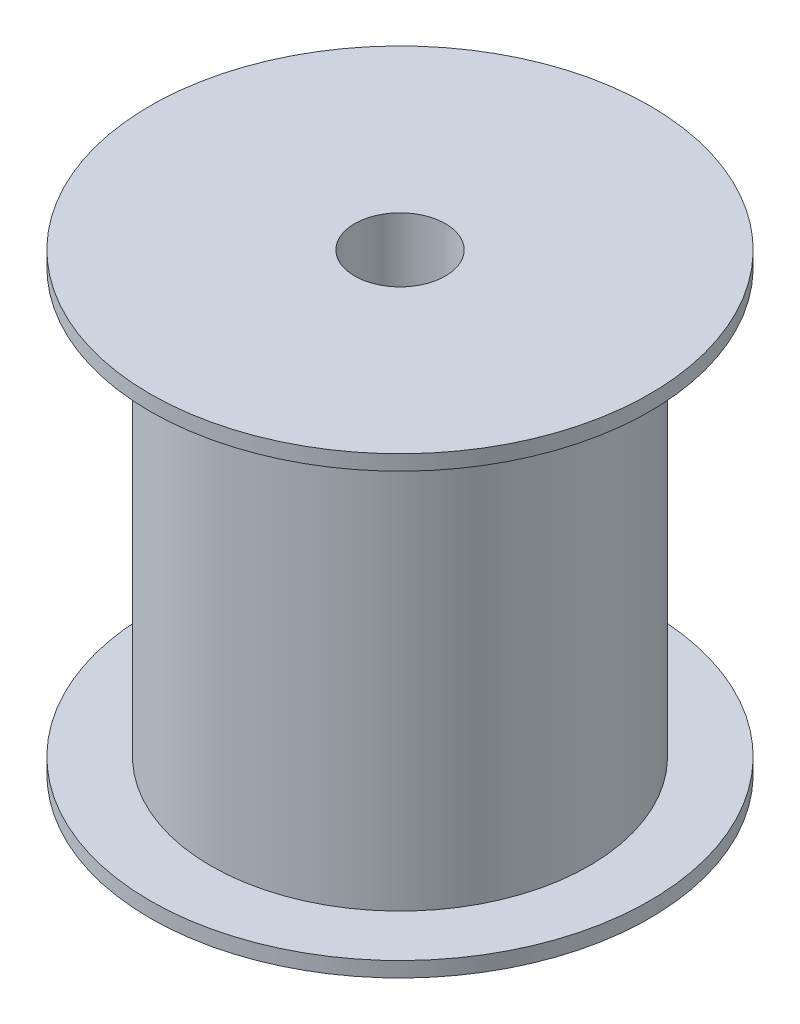
ISO-10303-21;
HEADER;
FILE_DESCRIPTION(('STEP AP214'),'2;1');
FILE_NAME('part.step','',(''),(''),'','','');
FILE_SCHEMA(('AUTOMOTIVE_DESIGN { 1 0 10303 214 1 1 1 1 }'));
ENDSEC;
DATA;
#1=APPLICATION_CONTEXT('core data for automotive mechanical design processes');
#2=APPLICATION_PROTOCOL_DEFINITION('international standard','automotive_design',2000,#1);
#3=PRODUCT_CONTEXT('',#1,'mechanical');
#4=PRODUCT('Part','Part','',(#3));
#5=PRODUCT_RELATED_PRODUCT_CATEGORY('part','',(#4));
#6=PRODUCT_DEFINITION_FORMATION('','',#4);
#7=PRODUCT_DEFINITION_CONTEXT('part definition',#1,'design');
#8=PRODUCT_DEFINITION('design','',#6,#7);
#9=PRODUCT_DEFINITION_SHAPE('','',#8);
#10=(LENGTH_UNIT() NAMED_UNIT(*) SI_UNIT(.MILLI.,.METRE.));
#11=(NAMED_UNIT(*) PLANE_ANGLE_UNIT() SI_UNIT($,.RADIAN.));
#12=(NAMED_UNIT(*) SI_UNIT($,.STERADIAN.) SOLID_ANGLE_UNIT());
#13=UNCERTAINTY_MEASURE_WITH_UNIT(LENGTH_MEASURE(1.E-05),#10,'distance_accuracy_value','');
#14=(GEOMETRIC_REPRESENTATION_CONTEXT(3) GLOBAL_UNCERTAINTY_ASSIGNED_CONTEXT((#13)) GLOBAL_UNIT_ASSIGNED_CONTEXT((#10,
#11,#12)) REPRESENTATION_CONTEXT('',''));
#15=CARTESIAN_POINT('',(0.,0.,0.));
#16=DIRECTION('',(0.,0.,1.));
#17=DIRECTION('',(1.,0.,0.));
#18=AXIS2_PLACEMENT_3D('',#15,#16,#17);
#19=CARTESIAN_POINT('',(0.,30.,0.));
#20=DIRECTION('',(0.,-1.,0.));
#21=DIRECTION('',(0.,0.,-1.));
#22=AXIS2_PLACEMENT_3D('',#19,#20,#21);
#23=CYLINDRICAL_SURFACE('',#22,12.5);
#24=CARTESIAN_POINT('',(0.,1.,0.));
#25=DIRECTION('',(0.,1.,0.));
#26=DIRECTION('',(0.,0.,1.));
#27=AXIS2_PLACEMENT_3D('',#24,#25,#26);
#28=CIRCLE('',#27,12.5);
#29=CARTESIAN_POINT('',(0.,1.,12.5));
#30=VERTEX_POINT('',#29);
#31=EDGE_CURVE('E47',#30,#30,#28,.T.);
#32=ORIENTED_EDGE('',*,*,#31,.T.);
#33=EDGE_LOOP('',(#32));
#34=FACE_BOUND('',#33,.T.);
#35=CARTESIAN_POINT('',(0.,29.,0.));
#36=DIRECTION('',(0.,1.,0.));
#37=DIRECTION('',(0.,0.,1.));
#38=AXIS2_PLACEMENT_3D('',#35,#36,#37);
#39=CIRCLE('',#38,12.5);
#40=CARTESIAN_POINT('',(0.,29.,12.5));
#41=VERTEX_POINT('',#40);
#42=EDGE_CURVE('E10',#41,#41,#39,.T.);
#43=ORIENTED_EDGE('',*,*,#42,.F.);
#44=EDGE_LOOP('',(#43));
#45=FACE_BOUND('',#44,.T.);
#46=ADVANCED_FACE('F32',(#34,#45),#23,.T.);
#47=CARTESIAN_POINT('',(0.,1.,0.));
#48=DIRECTION('',(0.,1.,0.));
#49=DIRECTION('',(0.,0.,1.));
#50=AXIS2_PLACEMENT_3D('',#47,#48,#49);
#51=PLANE('',#50);
#52=CARTESIAN_POINT('',(0.,1.,0.));
#53=DIRECTION('',(0.,1.,0.));
#54=DIRECTION('',(0.,0.,1.));
#55=AXIS2_PLACEMENT_3D('',#52,#53,#54);
#56=CIRCLE('',#55,16.5);
#57=CARTESIAN_POINT('',(0.,1.,16.5));
#58=VERTEX_POINT('',#57);
#59=EDGE_CURVE('E38',#58,#58,#56,.T.);
#60=ORIENTED_EDGE('',*,*,#59,.T.);
#61=EDGE_LOOP('',(#60));
#62=FACE_BOUND('',#61,.T.);
#63=ORIENTED_EDGE('',*,*,#31,.F.);
#64=EDGE_LOOP('',(#63));
#65=FACE_BOUND('',#64,.T.);
#66=ADVANCED_FACE('F99',(#62,#65),#51,.T.);
#67=CARTESIAN_POINT('',(0.,1.,0.));
#68=DIRECTION('',(0.,-1.,0.));
#69=DIRECTION('',(0.,0.,-1.));
#70=AXIS2_PLACEMENT_3D('',#67,#68,#69);
#71=CYLINDRICAL_SURFACE('',#70,16.5);
#72=ORIENTED_EDGE('',*,*,#59,.F.);
#73=EDGE_LOOP('',(#72));
#74=FACE_BOUND('',#73,.T.);
#75=CARTESIAN_POINT('',(0.,0.,0.));
#76=DIRECTION('',(0.,1.,0.));
#77=DIRECTION('',(0.,0.,1.));
#78=AXIS2_PLACEMENT_3D('',#75,#76,#77);
#79=CIRCLE('',#78,16.5);
#80=CARTESIAN_POINT('',(0.,0.,16.5));
#81=VERTEX_POINT('',#80);
#82=EDGE_CURVE('E42',#81,#81,#79,.T.);
#83=ORIENTED_EDGE('',*,*,#82,.T.);
#84=EDGE_LOOP('',(#83));
#85=FACE_BOUND('',#84,.T.);
#86=ADVANCED_FACE('F104',(#74,#85),#71,.T.);
#87=CARTESIAN_POINT('',(0.,0.,0.));
#88=DIRECTION('',(0.,1.,0.));
#89=DIRECTION('',(0.,0.,1.));
#90=AXIS2_PLACEMENT_3D('',#87,#88,#89);
#91=PLANE('',#90);
#92=CARTESIAN_POINT('',(0.,0.,0.));
#93=DIRECTION('',(0.,-1.,0.));
#94=DIRECTION('',(0.,0.,-1.));
#95=AXIS2_PLACEMENT_3D('',#92,#93,#94);
#96=CIRCLE('',#95,1.1525);
#97=CARTESIAN_POINT('',(0.,0.,-1.1525));
#98=VERTEX_POINT('',#97);
#99=EDGE_CURVE('E58',#98,#98,#96,.T.);
#100=ORIENTED_EDGE('',*,*,#99,.F.);
#101=EDGE_LOOP('',(#100));
#102=FACE_BOUND('',#101,.T.);
#103=ORIENTED_EDGE('',*,*,#82,.F.);
#104=EDGE_LOOP('',(#103));
#105=FACE_BOUND('',#104,.T.);
#106=ADVANCED_FACE('F94',(#102,#105),#91,.F.);
#107=CARTESIAN_POINT('',(0.,29.,0.));
#108=DIRECTION('',(0.,1.,0.));
#109=DIRECTION('',(0.,0.,1.));
#110=AXIS2_PLACEMENT_3D('',#107,#108,#109);
#111=PLANE('',#110);
#112=CARTESIAN_POINT('',(0.,29.,0.));
#113=DIRECTION('',(0.,1.,0.));
#114=DIRECTION('',(0.,0.,1.));
#115=AXIS2_PLACEMENT_3D('',#112,#113,#114);
#116=CIRCLE('',#115,16.5);
#117=CARTESIAN_POINT('',(0.,29.,16.5));
#118=VERTEX_POINT('',#117);
#119=EDGE_CURVE('E51',#118,#118,#116,.T.);
#120=ORIENTED_EDGE('',*,*,#119,.F.);
#121=EDGE_LOOP('',(#120));
#122=FACE_BOUND('',#121,.T.);
#123=ORIENTED_EDGE('',*,*,#42,.T.);
#124=EDGE_LOOP('',(#123));
#125=FACE_BOUND('',#124,.T.);
#126=ADVANCED_FACE('F88',(#122,#125),#111,.F.);
#127=CARTESIAN_POINT('',(0.,29.,0.));
#128=DIRECTION('',(0.,1.,0.));
#129=DIRECTION('',(0.,0.,1.));
#130=AXIS2_PLACEMENT_3D('',#127,#128,#129);
#131=CYLINDRICAL_SURFACE('',#130,16.5);
#132=ORIENTED_EDGE('',*,*,#119,.T.);
#133=EDGE_LOOP('',(#132));
#134=FACE_BOUND('',#133,.T.);
#135=CARTESIAN_POINT('',(0.,30.,0.));
#136=DIRECTION('',(0.,1.,0.));
#137=DIRECTION('',(0.,0.,1.));
#138=AXIS2_PLACEMENT_3D('',#135,#136,#137);
#139=CIRCLE('',#138,16.5);
#140=CARTESIAN_POINT('',(0.,30.,16.5));
#141=VERTEX_POINT('',#140);
#142=EDGE_CURVE('E52',#141,#141,#139,.T.);
#143=ORIENTED_EDGE('',*,*,#142,.F.);
#144=EDGE_LOOP('',(#143));
#145=FACE_BOUND('',#144,.T.);
#146=ADVANCED_FACE('F83',(#134,#145),#131,.T.);
#147=CARTESIAN_POINT('',(0.,30.,0.));
#148=DIRECTION('',(0.,1.,0.));
#149=DIRECTION('',(0.,0.,1.));
#150=AXIS2_PLACEMENT_3D('',#147,#148,#149);
#151=PLANE('',#150);
#152=CARTESIAN_POINT('',(0.,30.,0.));
#153=DIRECTION('',(0.,1.,0.));
#154=DIRECTION('',(0.,0.,1.));
#155=AXIS2_PLACEMENT_3D('',#152,#153,#154);
#156=CIRCLE('',#155,3.);
#157=CARTESIAN_POINT('',(0.,30.,3.));
#158=VERTEX_POINT('',#157);
#159=EDGE_CURVE('E64',#158,#158,#156,.T.);
#160=ORIENTED_EDGE('',*,*,#159,.F.);
#161=EDGE_LOOP('',(#160));
#162=FACE_BOUND('',#161,.T.);
#163=ORIENTED_EDGE('',*,*,#142,.T.);
#164=EDGE_LOOP('',(#163));
#165=FACE_BOUND('',#164,.T.);
#166=ADVANCED_FACE('F79',(#162,#165),#151,.T.);
#167=CARTESIAN_POINT('',(0.,6.,0.));
#168=DIRECTION('',(0.,-1.,0.));
#169=DIRECTION('',(0.,0.,-1.));
#170=AXIS2_PLACEMENT_3D('',#167,#168,#169);
#171=CYLINDRICAL_SURFACE('',#170,1.1525);
#172=CARTESIAN_POINT('',(0.,6.,0.));
#173=DIRECTION('',(0.,-1.,0.));
#174=DIRECTION('',(0.,0.,-1.));
#175=AXIS2_PLACEMENT_3D('',#172,#173,#174);
#176=CIRCLE('',#175,1.1525);
#177=CARTESIAN_POINT('',(0.,6.,-1.1525));
#178=VERTEX_POINT('',#177);
#179=EDGE_CURVE('E55',#178,#178,#176,.T.);
#180=ORIENTED_EDGE('',*,*,#179,.F.);
#181=EDGE_LOOP('',(#180));
#182=FACE_BOUND('',#181,.T.);
#183=ORIENTED_EDGE('',*,*,#99,.T.);
#184=EDGE_LOOP('',(#183));
#185=FACE_BOUND('',#184,.T.);
#186=ADVANCED_FACE('F82',(#182,#185),#171,.F.);
#187=CARTESIAN_POINT('',(0.,6.,0.));
#188=DIRECTION('',(0.,-1.,0.));
#189=DIRECTION('',(0.,0.,-1.));
#190=AXIS2_PLACEMENT_3D('',#187,#188,#189);
#191=PLANE('',#190);
#192=ORIENTED_EDGE('',*,*,#179,.T.);
#193=EDGE_LOOP('',(#192));
#194=FACE_BOUND('',#193,.T.);
#195=ADVANCED_FACE('F75',(#194),#191,.T.);
#196=CARTESIAN_POINT('',(0.,25.,0.));
#197=DIRECTION('',(0.,1.,0.));
#198=DIRECTION('',(0.,0.,1.));
#199=AXIS2_PLACEMENT_3D('',#196,#197,#198);
#200=CYLINDRICAL_SURFACE('',#199,3.);
#201=CARTESIAN_POINT('',(0.,25.,0.));
#202=DIRECTION('',(0.,1.,0.));
#203=DIRECTION('',(0.,0.,1.));
#204=AXIS2_PLACEMENT_3D('',#201,#202,#203);
#205=CIRCLE('',#204,3.);
#206=CARTESIAN_POINT('',(0.,25.,3.));
#207=VERTEX_POINT('',#206);
#208=EDGE_CURVE('E61',#207,#207,#205,.T.);
#209=ORIENTED_EDGE('',*,*,#208,.F.);
#210=EDGE_LOOP('',(#209));
#211=FACE_BOUND('',#210,.T.);
#212=ORIENTED_EDGE('',*,*,#159,.T.);
#213=EDGE_LOOP('',(#212));
#214=FACE_BOUND('',#213,.T.);
#215=ADVANCED_FACE('F72',(#211,#214),#200,.F.);
#216=CARTESIAN_POINT('',(0.,25.,0.));
#217=DIRECTION('',(0.,1.,0.));
#218=DIRECTION('',(0.,0.,1.));
#219=AXIS2_PLACEMENT_3D('',#216,#217,#218);
#220=PLANE('',#219);
#221=ORIENTED_EDGE('',*,*,#208,.T.);
#222=EDGE_LOOP('',(#221));
#223=FACE_BOUND('',#222,.T.);
#224=ADVANCED_FACE('F70',(#223),#220,.T.);
#225=CLOSED_SHELL('',(#46,#66,#86,#106,#126,#146,#166,#186,#195,#215,#224));
#226=MANIFOLD_SOLID_BREP('B2',#225);
#227=ADVANCED_BREP_SHAPE_REPRESENTATION('',(#18,#226),#14);
#228=SHAPE_DEFINITION_REPRESENTATION(#9,#227);
ENDSEC;
END-ISO-10303-21;
